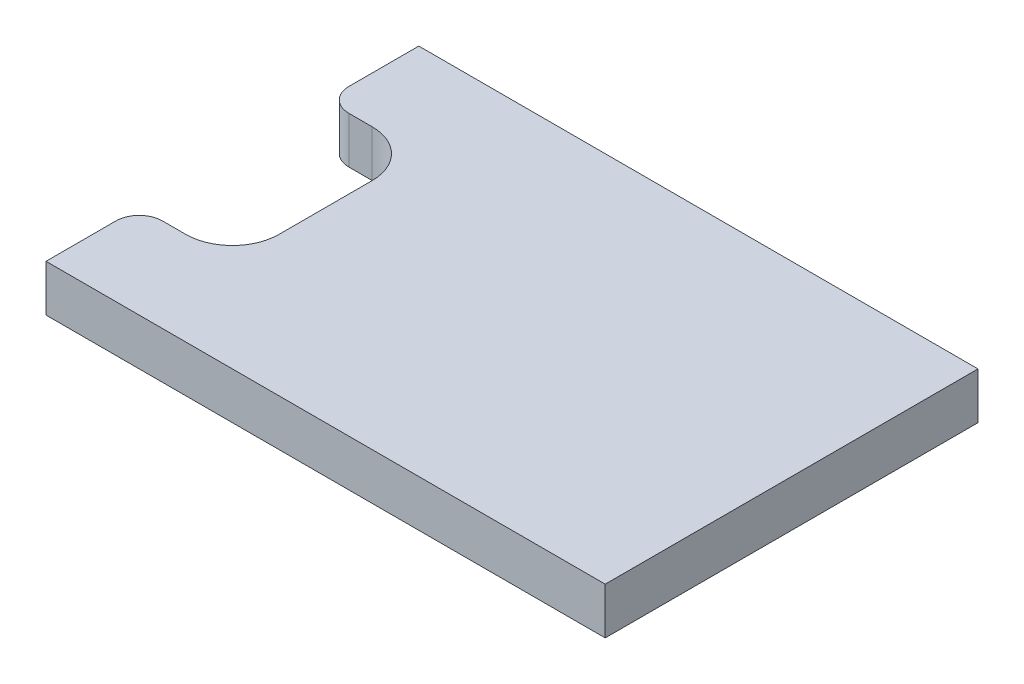
ISO-10303-21;
HEADER;
FILE_DESCRIPTION(('STEP AP214'),'2;1');
FILE_NAME('part.step','',(''),(''),'','','');
FILE_SCHEMA(('AUTOMOTIVE_DESIGN { 1 0 10303 214 1 1 1 1 }'));
ENDSEC;
DATA;
#1=APPLICATION_CONTEXT('core data for automotive mechanical design processes');
#2=APPLICATION_PROTOCOL_DEFINITION('international standard','automotive_design',2000,#1);
#3=PRODUCT_CONTEXT('',#1,'mechanical');
#4=PRODUCT('Part','Part','',(#3));
#5=PRODUCT_RELATED_PRODUCT_CATEGORY('part','',(#4));
#6=PRODUCT_DEFINITION_FORMATION('','',#4);
#7=PRODUCT_DEFINITION_CONTEXT('part definition',#1,'design');
#8=PRODUCT_DEFINITION('design','',#6,#7);
#9=PRODUCT_DEFINITION_SHAPE('','',#8);
#10=(LENGTH_UNIT() NAMED_UNIT(*) SI_UNIT(.MILLI.,.METRE.));
#11=(NAMED_UNIT(*) PLANE_ANGLE_UNIT() SI_UNIT($,.RADIAN.));
#12=(NAMED_UNIT(*) SI_UNIT($,.STERADIAN.) SOLID_ANGLE_UNIT());
#13=UNCERTAINTY_MEASURE_WITH_UNIT(LENGTH_MEASURE(1.E-05),#10,'distance_accuracy_value','');
#14=(GEOMETRIC_REPRESENTATION_CONTEXT(3) GLOBAL_UNCERTAINTY_ASSIGNED_CONTEXT((#13)) GLOBAL_UNIT_ASSIGNED_CONTEXT((#10,
#11,#12)) REPRESENTATION_CONTEXT('',''));
#15=CARTESIAN_POINT('',(0.,0.,0.));
#16=DIRECTION('',(0.,0.,1.));
#17=DIRECTION('',(1.,0.,0.));
#18=AXIS2_PLACEMENT_3D('',#15,#16,#17);
#19=CARTESIAN_POINT('',(-86.4894600922342,-159.999999999984,26.9212642700331));
#20=DIRECTION('',(1.,0.,0.));
#21=DIRECTION('',(0.,0.,-1.));
#22=AXIS2_PLACEMENT_3D('',#19,#20,#21);
#23=PLANE('',#22);
#24=DIRECTION('',(0.,0.,-1.));
#25=VECTOR('',#24,1.);
#26=CARTESIAN_POINT('',(-86.4894600922342,-159.999999999984,26.9212642700331));
#27=LINE('',#26,#25);
#28=CARTESIAN_POINT('',(-86.4894600922342,-159.999999999984,-38.0787357299669));
#29=VERTEX_POINT('',#28);
#30=CARTESIAN_POINT('',(-86.4894600922342,-159.999999999984,-53.0787357299669));
#31=VERTEX_POINT('',#30);
#32=EDGE_CURVE('E119',#29,#31,#27,.T.);
#33=ORIENTED_EDGE('',*,*,#32,.F.);
#34=DIRECTION('',(0.,1.,0.));
#35=VECTOR('',#34,1.);
#36=CARTESIAN_POINT('',(-86.4894600922342,-159.999999999984,-38.0787357299669));
#37=LINE('',#36,#35);
#38=CARTESIAN_POINT('',(-86.4894600922342,-149.999999999984,-38.0787357299669));
#39=VERTEX_POINT('',#38);
#40=EDGE_CURVE('E41',#29,#39,#37,.T.);
#41=ORIENTED_EDGE('',*,*,#40,.T.);
#42=DIRECTION('',(0.,0.,-1.));
#43=VECTOR('',#42,1.);
#44=CARTESIAN_POINT('',(-86.4894600922342,-149.999999999984,26.9212642700331));
#45=LINE('',#44,#43);
#46=CARTESIAN_POINT('',(-86.4894600922342,-149.999999999984,-53.0787357299669));
#47=VERTEX_POINT('',#46);
#48=EDGE_CURVE('E142',#39,#47,#45,.T.);
#49=ORIENTED_EDGE('',*,*,#48,.T.);
#50=DIRECTION('',(0.,1.,0.));
#51=VECTOR('',#50,1.);
#52=CARTESIAN_POINT('',(-86.4894600922342,-159.999999999984,-53.0787357299669));
#53=LINE('',#52,#51);
#54=EDGE_CURVE('E135',#31,#47,#53,.T.);
#55=ORIENTED_EDGE('',*,*,#54,.F.);
#56=EDGE_LOOP('',(#33,#41,#49,#55));
#57=FACE_BOUND('',#56,.T.);
#58=ADVANCED_FACE('F33',(#57),#23,.F.);
#59=CARTESIAN_POINT('',(-86.4894600922342,-149.999999999984,26.9212642700331));
#60=VERTEX_POINT('',#59);
#61=CARTESIAN_POINT('',(-86.4894600922342,-149.999999999984,11.9212642700331));
#62=VERTEX_POINT('',#61);
#63=EDGE_CURVE('E187',#60,#62,#45,.T.);
#64=ORIENTED_EDGE('',*,*,#63,.T.);
#65=DIRECTION('',(0.,1.,0.));
#66=VECTOR('',#65,1.);
#67=CARTESIAN_POINT('',(-86.4894600922342,-159.999999999984,11.9212642700331));
#68=LINE('',#67,#66);
#69=CARTESIAN_POINT('',(-86.4894600922342,-159.999999999984,11.9212642700331));
#70=VERTEX_POINT('',#69);
#71=EDGE_CURVE('E176',#62,#70,#68,.F.);
#72=ORIENTED_EDGE('',*,*,#71,.T.);
#73=CARTESIAN_POINT('',(-86.4894600922342,-159.999999999984,26.9212642700331));
#74=VERTEX_POINT('',#73);
#75=EDGE_CURVE('E129',#74,#70,#27,.T.);
#76=ORIENTED_EDGE('',*,*,#75,.F.);
#77=DIRECTION('',(0.,1.,0.));
#78=VECTOR('',#77,1.);
#79=CARTESIAN_POINT('',(-86.4894600922342,-159.999999999984,26.9212642700331));
#80=LINE('',#79,#78);
#81=EDGE_CURVE('E201',#74,#60,#80,.T.);
#82=ORIENTED_EDGE('',*,*,#81,.T.);
#83=EDGE_LOOP('',(#64,#72,#76,#82));
#84=FACE_BOUND('',#83,.T.);
#85=ADVANCED_FACE('F214',(#84),#23,.F.);
#86=CARTESIAN_POINT('',(-86.4894600922342,-159.999999999984,-53.0787357299669));
#87=DIRECTION('',(0.,0.,1.));
#88=DIRECTION('',(1.,0.,0.));
#89=AXIS2_PLACEMENT_3D('',#86,#87,#88);
#90=PLANE('',#89);
#91=DIRECTION('',(1.,0.,0.));
#92=VECTOR('',#91,1.);
#93=CARTESIAN_POINT('',(-86.4894600922342,-149.999999999984,-53.0787357299669));
#94=LINE('',#93,#92);
#95=CARTESIAN_POINT('',(33.5105399077658,-149.999999999984,-53.0787357299669));
#96=VERTEX_POINT('',#95);
#97=EDGE_CURVE('E186',#47,#96,#94,.T.);
#98=ORIENTED_EDGE('',*,*,#97,.T.);
#99=DIRECTION('',(0.,1.,0.));
#100=VECTOR('',#99,1.);
#101=CARTESIAN_POINT('',(33.5105399077658,-159.999999999984,-53.0787357299669));
#102=LINE('',#101,#100);
#103=CARTESIAN_POINT('',(33.5105399077658,-159.999999999984,-53.0787357299669));
#104=VERTEX_POINT('',#103);
#105=EDGE_CURVE('E137',#104,#96,#102,.T.);
#106=ORIENTED_EDGE('',*,*,#105,.F.);
#107=DIRECTION('',(1.,0.,0.));
#108=VECTOR('',#107,1.);
#109=CARTESIAN_POINT('',(-86.4894600922342,-159.999999999984,-53.0787357299669));
#110=LINE('',#109,#108);
#111=EDGE_CURVE('E123',#31,#104,#110,.T.);
#112=ORIENTED_EDGE('',*,*,#111,.F.);
#113=ORIENTED_EDGE('',*,*,#54,.T.);
#114=EDGE_LOOP('',(#98,#106,#112,#113));
#115=FACE_BOUND('',#114,.T.);
#116=ADVANCED_FACE('F134',(#115),#90,.F.);
#117=CARTESIAN_POINT('',(33.5105399077658,-159.999999999984,26.9212642700331));
#118=DIRECTION('',(-1.,0.,0.));
#119=DIRECTION('',(0.,0.,1.));
#120=AXIS2_PLACEMENT_3D('',#117,#118,#119);
#121=PLANE('',#120);
#122=DIRECTION('',(0.,0.,1.));
#123=VECTOR('',#122,1.);
#124=CARTESIAN_POINT('',(33.5105399077658,-149.999999999984,26.9212642700331));
#125=LINE('',#124,#123);
#126=CARTESIAN_POINT('',(33.5105399077658,-149.999999999984,26.9212642700331));
#127=VERTEX_POINT('',#126);
#128=EDGE_CURVE('E198',#96,#127,#125,.T.);
#129=ORIENTED_EDGE('',*,*,#128,.T.);
#130=DIRECTION('',(0.,1.,0.));
#131=VECTOR('',#130,1.);
#132=CARTESIAN_POINT('',(33.5105399077658,-159.999999999984,26.9212642700331));
#133=LINE('',#132,#131);
#134=CARTESIAN_POINT('',(33.5105399077658,-159.999999999984,26.9212642700331));
#135=VERTEX_POINT('',#134);
#136=EDGE_CURVE('E148',#135,#127,#133,.T.);
#137=ORIENTED_EDGE('',*,*,#136,.F.);
#138=DIRECTION('',(0.,0.,1.));
#139=VECTOR('',#138,1.);
#140=CARTESIAN_POINT('',(33.5105399077658,-159.999999999984,26.9212642700331));
#141=LINE('',#140,#139);
#142=EDGE_CURVE('E139',#104,#135,#141,.T.);
#143=ORIENTED_EDGE('',*,*,#142,.F.);
#144=ORIENTED_EDGE('',*,*,#105,.T.);
#145=EDGE_LOOP('',(#129,#137,#143,#144));
#146=FACE_BOUND('',#145,.T.);
#147=ADVANCED_FACE('F236',(#146),#121,.F.);
#148=CARTESIAN_POINT('',(-86.4894600922342,-159.999999999984,26.9212642700331));
#149=DIRECTION('',(0.,0.,-1.));
#150=DIRECTION('',(-1.,0.,0.));
#151=AXIS2_PLACEMENT_3D('',#148,#149,#150);
#152=PLANE('',#151);
#153=DIRECTION('',(-1.,0.,0.));
#154=VECTOR('',#153,1.);
#155=CARTESIAN_POINT('',(-86.4894600922342,-149.999999999984,26.9212642700331));
#156=LINE('',#155,#154);
#157=EDGE_CURVE('E130',#127,#60,#156,.T.);
#158=ORIENTED_EDGE('',*,*,#157,.T.);
#159=ORIENTED_EDGE('',*,*,#81,.F.);
#160=DIRECTION('',(-1.,0.,0.));
#161=VECTOR('',#160,1.);
#162=CARTESIAN_POINT('',(-86.4894600922342,-159.999999999984,26.9212642700331));
#163=LINE('',#162,#161);
#164=EDGE_CURVE('E195',#135,#74,#163,.T.);
#165=ORIENTED_EDGE('',*,*,#164,.F.);
#166=ORIENTED_EDGE('',*,*,#136,.T.);
#167=EDGE_LOOP('',(#158,#159,#165,#166));
#168=FACE_BOUND('',#167,.T.);
#169=ADVANCED_FACE('F208',(#168),#152,.F.);
#170=CARTESIAN_POINT('',(-86.4894600922342,-159.999999999984,-53.0787357299669));
#171=DIRECTION('',(0.,-1.,0.));
#172=DIRECTION('',(0.,0.,-1.));
#173=AXIS2_PLACEMENT_3D('',#170,#171,#172);
#174=PLANE('',#173);
#175=ORIENTED_EDGE('',*,*,#75,.T.);
#176=CARTESIAN_POINT('',(-81.4894600922342,-159.999999999984,11.9212642700331));
#177=DIRECTION('',(0.,-1.,0.));
#178=DIRECTION('',(0.,0.,-1.));
#179=AXIS2_PLACEMENT_3D('',#176,#177,#178);
#180=CIRCLE('',#179,5.);
#181=CARTESIAN_POINT('',(-81.4894600922342,-159.999999999984,6.92126427003306));
#182=VERTEX_POINT('',#181);
#183=EDGE_CURVE('E179',#70,#182,#180,.T.);
#184=ORIENTED_EDGE('',*,*,#183,.T.);
#185=DIRECTION('',(1.,0.,0.));
#186=VECTOR('',#185,1.);
#187=CARTESIAN_POINT('',(-86.4894600922342,-159.999999999984,6.92126427003306));
#188=LINE('',#187,#186);
#189=CARTESIAN_POINT('',(-76.4894600922342,-159.999999999984,6.92126427003306));
#190=VERTEX_POINT('',#189);
#191=EDGE_CURVE('E221',#182,#190,#188,.T.);
#192=ORIENTED_EDGE('',*,*,#191,.T.);
#193=CARTESIAN_POINT('',(-76.4894600922342,-159.999999999984,-3.07873572996694));
#194=DIRECTION('',(0.,-1.,0.));
#195=DIRECTION('',(0.,0.,-1.));
#196=AXIS2_PLACEMENT_3D('',#193,#194,#195);
#197=CIRCLE('',#196,10.);
#198=CARTESIAN_POINT('',(-66.4894600922342,-159.999999999984,-3.07873572996694));
#199=VERTEX_POINT('',#198);
#200=EDGE_CURVE('E163',#190,#199,#197,.F.);
#201=ORIENTED_EDGE('',*,*,#200,.T.);
#202=DIRECTION('',(0.,0.,-1.));
#203=VECTOR('',#202,1.);
#204=CARTESIAN_POINT('',(-66.4894600922342,-159.999999999984,-33.0787357299669));
#205=LINE('',#204,#203);
#206=CARTESIAN_POINT('',(-66.4894600922342,-159.999999999984,-23.0787357299669));
#207=VERTEX_POINT('',#206);
#208=EDGE_CURVE('E191',#199,#207,#205,.T.);
#209=ORIENTED_EDGE('',*,*,#208,.T.);
#210=CARTESIAN_POINT('',(-76.4894600922342,-159.999999999984,-23.0787357299669));
#211=DIRECTION('',(0.,-1.,0.));
#212=DIRECTION('',(0.,0.,-1.));
#213=AXIS2_PLACEMENT_3D('',#210,#211,#212);
#214=CIRCLE('',#213,10.);
#215=CARTESIAN_POINT('',(-76.4894600922342,-159.999999999984,-33.0787357299669));
#216=VERTEX_POINT('',#215);
#217=EDGE_CURVE('E167',#207,#216,#214,.F.);
#218=ORIENTED_EDGE('',*,*,#217,.T.);
#219=DIRECTION('',(-1.,0.,0.));
#220=VECTOR('',#219,1.);
#221=CARTESIAN_POINT('',(-86.4894600922342,-159.999999999984,-33.0787357299669));
#222=LINE('',#221,#220);
#223=CARTESIAN_POINT('',(-81.4894600922342,-159.999999999984,-33.0787357299669));
#224=VERTEX_POINT('',#223);
#225=EDGE_CURVE('E188',#216,#224,#222,.T.);
#226=ORIENTED_EDGE('',*,*,#225,.T.);
#227=CARTESIAN_POINT('',(-81.4894600922342,-159.999999999984,-38.0787357299669));
#228=DIRECTION('',(0.,-1.,0.));
#229=DIRECTION('',(0.,0.,-1.));
#230=AXIS2_PLACEMENT_3D('',#227,#228,#229);
#231=CIRCLE('',#230,5.);
#232=EDGE_CURVE('E48',#224,#29,#231,.T.);
#233=ORIENTED_EDGE('',*,*,#232,.T.);
#234=ORIENTED_EDGE('',*,*,#32,.T.);
#235=ORIENTED_EDGE('',*,*,#111,.T.);
#236=ORIENTED_EDGE('',*,*,#142,.T.);
#237=ORIENTED_EDGE('',*,*,#164,.T.);
#238=EDGE_LOOP('',(#175,#184,#192,#201,#209,#218,#226,#233,#234,#235,#236,#237));
#239=FACE_BOUND('',#238,.T.);
#240=ADVANCED_FACE('F122',(#239),#174,.T.);
#241=CARTESIAN_POINT('',(-86.4894600922342,-149.999999999984,-53.0787357299669));
#242=DIRECTION('',(0.,-1.,0.));
#243=DIRECTION('',(0.,0.,-1.));
#244=AXIS2_PLACEMENT_3D('',#241,#242,#243);
#245=PLANE('',#244);
#246=DIRECTION('',(1.,0.,0.));
#247=VECTOR('',#246,1.);
#248=CARTESIAN_POINT('',(-86.4894600922342,-149.999999999984,6.92126427003306));
#249=LINE('',#248,#247);
#250=CARTESIAN_POINT('',(-81.4894600922342,-149.999999999984,6.92126427003306));
#251=VERTEX_POINT('',#250);
#252=CARTESIAN_POINT('',(-76.4894600922342,-149.999999999984,6.92126427003306));
#253=VERTEX_POINT('',#252);
#254=EDGE_CURVE('E233',#251,#253,#249,.T.);
#255=ORIENTED_EDGE('',*,*,#254,.F.);
#256=CARTESIAN_POINT('',(-81.4894600922342,-149.999999999984,11.9212642700331));
#257=DIRECTION('',(0.,-1.,0.));
#258=DIRECTION('',(0.,0.,-1.));
#259=AXIS2_PLACEMENT_3D('',#256,#257,#258);
#260=CIRCLE('',#259,5.);
#261=EDGE_CURVE('E174',#251,#62,#260,.F.);
#262=ORIENTED_EDGE('',*,*,#261,.T.);
#263=ORIENTED_EDGE('',*,*,#63,.F.);
#264=ORIENTED_EDGE('',*,*,#157,.F.);
#265=ORIENTED_EDGE('',*,*,#128,.F.);
#266=ORIENTED_EDGE('',*,*,#97,.F.);
#267=ORIENTED_EDGE('',*,*,#48,.F.);
#268=CARTESIAN_POINT('',(-81.4894600922342,-149.999999999984,-38.0787357299669));
#269=DIRECTION('',(0.,-1.,0.));
#270=DIRECTION('',(0.,0.,-1.));
#271=AXIS2_PLACEMENT_3D('',#268,#269,#270);
#272=CIRCLE('',#271,5.);
#273=CARTESIAN_POINT('',(-81.4894600922342,-149.999999999984,-33.0787357299669));
#274=VERTEX_POINT('',#273);
#275=EDGE_CURVE('E172',#39,#274,#272,.F.);
#276=ORIENTED_EDGE('',*,*,#275,.T.);
#277=DIRECTION('',(-1.,0.,0.));
#278=VECTOR('',#277,1.);
#279=CARTESIAN_POINT('',(-86.4894600922342,-149.999999999984,-33.0787357299669));
#280=LINE('',#279,#278);
#281=CARTESIAN_POINT('',(-76.4894600922342,-149.999999999984,-33.0787357299669));
#282=VERTEX_POINT('',#281);
#283=EDGE_CURVE('E226',#282,#274,#280,.T.);
#284=ORIENTED_EDGE('',*,*,#283,.F.);
#285=CARTESIAN_POINT('',(-76.4894600922342,-149.999999999984,-23.0787357299669));
#286=DIRECTION('',(0.,-1.,0.));
#287=DIRECTION('',(0.,0.,-1.));
#288=AXIS2_PLACEMENT_3D('',#285,#286,#287);
#289=CIRCLE('',#288,10.);
#290=CARTESIAN_POINT('',(-66.4894600922342,-149.999999999984,-23.0787357299669));
#291=VERTEX_POINT('',#290);
#292=EDGE_CURVE('E165',#282,#291,#289,.T.);
#293=ORIENTED_EDGE('',*,*,#292,.T.);
#294=DIRECTION('',(0.,0.,-1.));
#295=VECTOR('',#294,1.);
#296=CARTESIAN_POINT('',(-66.4894600922342,-149.999999999984,-33.0787357299669));
#297=LINE('',#296,#295);
#298=CARTESIAN_POINT('',(-66.4894600922342,-149.999999999984,-3.07873572996694));
#299=VERTEX_POINT('',#298);
#300=EDGE_CURVE('E230',#299,#291,#297,.T.);
#301=ORIENTED_EDGE('',*,*,#300,.F.);
#302=CARTESIAN_POINT('',(-76.4894600922342,-149.999999999984,-3.07873572996694));
#303=DIRECTION('',(0.,-1.,0.));
#304=DIRECTION('',(0.,0.,-1.));
#305=AXIS2_PLACEMENT_3D('',#302,#303,#304);
#306=CIRCLE('',#305,10.);
#307=EDGE_CURVE('E160',#299,#253,#306,.T.);
#308=ORIENTED_EDGE('',*,*,#307,.T.);
#309=EDGE_LOOP('',(#255,#262,#263,#264,#265,#266,#267,#276,#284,#293,#301,#308));
#310=FACE_BOUND('',#309,.T.);
#311=ADVANCED_FACE('F183',(#310),#245,.F.);
#312=CARTESIAN_POINT('',(-86.4894600922342,-159.999999999984,-33.0787357299669));
#313=DIRECTION('',(0.,0.,-1.));
#314=DIRECTION('',(-1.,0.,0.));
#315=AXIS2_PLACEMENT_3D('',#312,#313,#314);
#316=PLANE('',#315);
#317=ORIENTED_EDGE('',*,*,#283,.T.);
#318=DIRECTION('',(0.,1.,0.));
#319=VECTOR('',#318,1.);
#320=CARTESIAN_POINT('',(-81.4894600922342,-159.999999999984,-33.0787357299669));
#321=LINE('',#320,#319);
#322=EDGE_CURVE('E11',#274,#224,#321,.F.);
#323=ORIENTED_EDGE('',*,*,#322,.T.);
#324=ORIENTED_EDGE('',*,*,#225,.F.);
#325=DIRECTION('',(0.,1.,0.));
#326=VECTOR('',#325,1.);
#327=CARTESIAN_POINT('',(-76.4894600922342,-149.999999999984,-33.0787357299669));
#328=LINE('',#327,#326);
#329=EDGE_CURVE('E157',#216,#282,#328,.T.);
#330=ORIENTED_EDGE('',*,*,#329,.T.);
#331=EDGE_LOOP('',(#317,#323,#324,#330));
#332=FACE_BOUND('',#331,.T.);
#333=ADVANCED_FACE('F286',(#332),#316,.F.);
#334=CARTESIAN_POINT('',(-66.4894600922342,-159.999999999984,-33.0787357299669));
#335=DIRECTION('',(1.,0.,0.));
#336=DIRECTION('',(0.,0.,-1.));
#337=AXIS2_PLACEMENT_3D('',#334,#335,#336);
#338=PLANE('',#337);
#339=ORIENTED_EDGE('',*,*,#208,.F.);
#340=DIRECTION('',(0.,1.,0.));
#341=VECTOR('',#340,1.);
#342=CARTESIAN_POINT('',(-66.4894600922342,-149.999999999984,-3.07873572996694));
#343=LINE('',#342,#341);
#344=EDGE_CURVE('E146',#199,#299,#343,.T.);
#345=ORIENTED_EDGE('',*,*,#344,.T.);
#346=ORIENTED_EDGE('',*,*,#300,.T.);
#347=DIRECTION('',(0.,1.,0.));
#348=VECTOR('',#347,1.);
#349=CARTESIAN_POINT('',(-66.4894600922342,-159.999999999984,-23.0787357299669));
#350=LINE('',#349,#348);
#351=EDGE_CURVE('E144',#291,#207,#350,.F.);
#352=ORIENTED_EDGE('',*,*,#351,.T.);
#353=EDGE_LOOP('',(#339,#345,#346,#352));
#354=FACE_BOUND('',#353,.T.);
#355=ADVANCED_FACE('F278',(#354),#338,.F.);
#356=CARTESIAN_POINT('',(-86.4894600922342,-159.999999999984,6.92126427003306));
#357=DIRECTION('',(0.,0.,1.));
#358=DIRECTION('',(1.,0.,0.));
#359=AXIS2_PLACEMENT_3D('',#356,#357,#358);
#360=PLANE('',#359);
#361=ORIENTED_EDGE('',*,*,#191,.F.);
#362=DIRECTION('',(0.,1.,0.));
#363=VECTOR('',#362,1.);
#364=CARTESIAN_POINT('',(-81.4894600922342,-159.999999999984,6.92126427003306));
#365=LINE('',#364,#363);
#366=EDGE_CURVE('E169',#182,#251,#365,.T.);
#367=ORIENTED_EDGE('',*,*,#366,.T.);
#368=ORIENTED_EDGE('',*,*,#254,.T.);
#369=DIRECTION('',(0.,1.,0.));
#370=VECTOR('',#369,1.);
#371=CARTESIAN_POINT('',(-76.4894600922342,-159.999999999984,6.92126427003306));
#372=LINE('',#371,#370);
#373=EDGE_CURVE('E154',#253,#190,#372,.F.);
#374=ORIENTED_EDGE('',*,*,#373,.T.);
#375=EDGE_LOOP('',(#361,#367,#368,#374));
#376=FACE_BOUND('',#375,.T.);
#377=ADVANCED_FACE('F223',(#376),#360,.F.);
#378=CARTESIAN_POINT('',(-76.4894600922342,-159.999999999984,-3.07873572996694));
#379=DIRECTION('',(0.,-1.,0.));
#380=DIRECTION('',(0.,0.,-1.));
#381=AXIS2_PLACEMENT_3D('',#378,#379,#380);
#382=CYLINDRICAL_SURFACE('',#381,10.);
#383=ORIENTED_EDGE('',*,*,#200,.F.);
#384=ORIENTED_EDGE('',*,*,#373,.F.);
#385=ORIENTED_EDGE('',*,*,#307,.F.);
#386=ORIENTED_EDGE('',*,*,#344,.F.);
#387=EDGE_LOOP('',(#383,#384,#385,#386));
#388=FACE_BOUND('',#387,.T.);
#389=ADVANCED_FACE('F251',(#388),#382,.F.);
#390=CARTESIAN_POINT('',(-76.4894600922342,-159.999999999984,-23.0787357299669));
#391=DIRECTION('',(0.,-1.,0.));
#392=DIRECTION('',(0.,0.,-1.));
#393=AXIS2_PLACEMENT_3D('',#390,#391,#392);
#394=CYLINDRICAL_SURFACE('',#393,10.);
#395=ORIENTED_EDGE('',*,*,#217,.F.);
#396=ORIENTED_EDGE('',*,*,#351,.F.);
#397=ORIENTED_EDGE('',*,*,#292,.F.);
#398=ORIENTED_EDGE('',*,*,#329,.F.);
#399=EDGE_LOOP('',(#395,#396,#397,#398));
#400=FACE_BOUND('',#399,.T.);
#401=ADVANCED_FACE('F254',(#400),#394,.F.);
#402=CARTESIAN_POINT('',(-81.4894600922342,-159.999999999984,11.9212642700331));
#403=DIRECTION('',(0.,1.,0.));
#404=DIRECTION('',(0.,0.,1.));
#405=AXIS2_PLACEMENT_3D('',#402,#403,#404);
#406=CYLINDRICAL_SURFACE('',#405,5.);
#407=ORIENTED_EDGE('',*,*,#183,.F.);
#408=ORIENTED_EDGE('',*,*,#71,.F.);
#409=ORIENTED_EDGE('',*,*,#261,.F.);
#410=ORIENTED_EDGE('',*,*,#366,.F.);
#411=EDGE_LOOP('',(#407,#408,#409,#410));
#412=FACE_BOUND('',#411,.T.);
#413=ADVANCED_FACE('F218',(#412),#406,.T.);
#414=CARTESIAN_POINT('',(-81.4894600922342,-159.999999999984,-38.0787357299669));
#415=DIRECTION('',(0.,1.,0.));
#416=DIRECTION('',(0.,0.,1.));
#417=AXIS2_PLACEMENT_3D('',#414,#415,#416);
#418=CYLINDRICAL_SURFACE('',#417,5.);
#419=ORIENTED_EDGE('',*,*,#232,.F.);
#420=ORIENTED_EDGE('',*,*,#322,.F.);
#421=ORIENTED_EDGE('',*,*,#275,.F.);
#422=ORIENTED_EDGE('',*,*,#40,.F.);
#423=EDGE_LOOP('',(#419,#420,#421,#422));
#424=FACE_BOUND('',#423,.T.);
#425=ADVANCED_FACE('F35',(#424),#418,.T.);
#426=CLOSED_SHELL('',(#58,#85,#116,#147,#169,#240,#311,#333,#355,#377,#389,#401,#413,#425));
#427=MANIFOLD_SOLID_BREP('B2',#426);
#428=ADVANCED_BREP_SHAPE_REPRESENTATION('',(#18,#427),#14);
#429=SHAPE_DEFINITION_REPRESENTATION(#9,#428);
ENDSEC;
END-ISO-10303-21;
